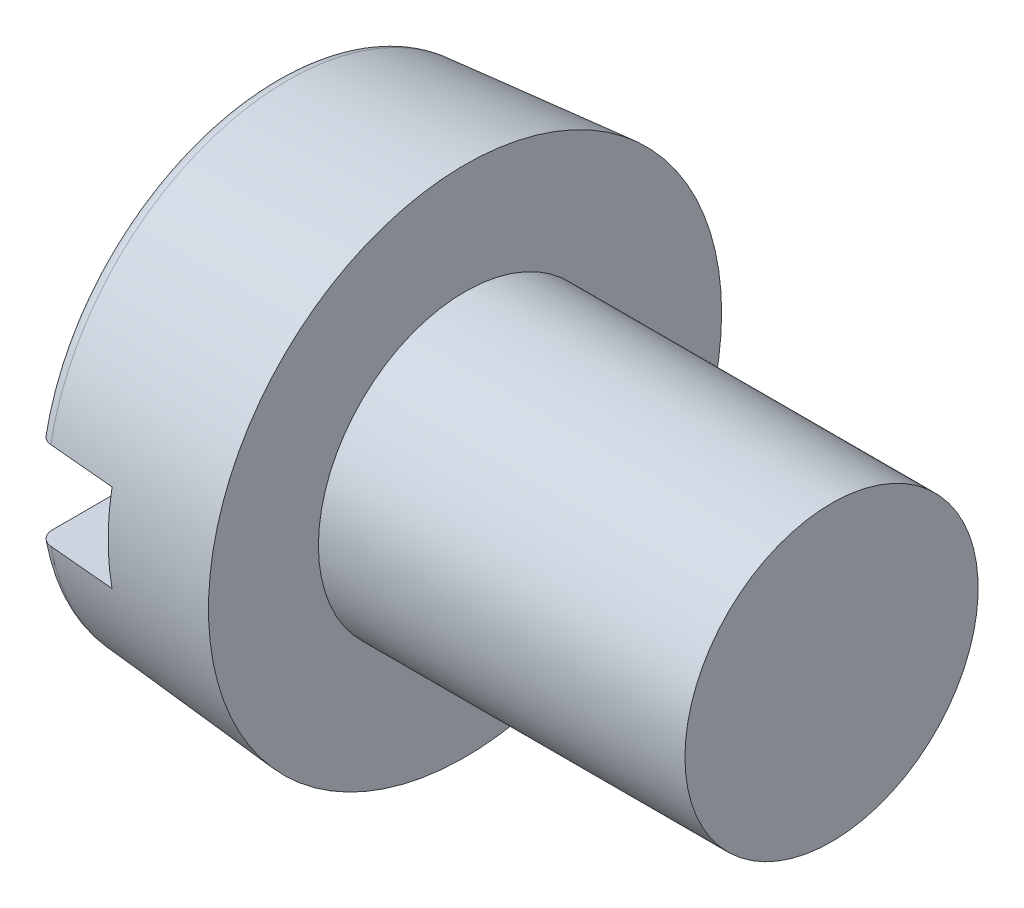
ISO-10303-21;
HEADER;
FILE_DESCRIPTION(('STEP AP214'),'2;1');
FILE_NAME('part.step','',(''),(''),'','','');
FILE_SCHEMA(('AUTOMOTIVE_DESIGN { 1 0 10303 214 1 1 1 1 }'));
ENDSEC;
DATA;
#1=APPLICATION_CONTEXT('core data for automotive mechanical design processes');
#2=APPLICATION_PROTOCOL_DEFINITION('international standard','automotive_design',2000,#1);
#3=PRODUCT_CONTEXT('',#1,'mechanical');
#4=PRODUCT('Part','Part','',(#3));
#5=PRODUCT_RELATED_PRODUCT_CATEGORY('part','',(#4));
#6=PRODUCT_DEFINITION_FORMATION('','',#4);
#7=PRODUCT_DEFINITION_CONTEXT('part definition',#1,'design');
#8=PRODUCT_DEFINITION('design','',#6,#7);
#9=PRODUCT_DEFINITION_SHAPE('','',#8);
#10=(LENGTH_UNIT() NAMED_UNIT(*) SI_UNIT(.MILLI.,.METRE.));
#11=(NAMED_UNIT(*) PLANE_ANGLE_UNIT() SI_UNIT($,.RADIAN.));
#12=(NAMED_UNIT(*) SI_UNIT($,.STERADIAN.) SOLID_ANGLE_UNIT());
#13=UNCERTAINTY_MEASURE_WITH_UNIT(LENGTH_MEASURE(1.E-05),#10,'distance_accuracy_value','');
#14=(GEOMETRIC_REPRESENTATION_CONTEXT(3) GLOBAL_UNCERTAINTY_ASSIGNED_CONTEXT((#13)) GLOBAL_UNIT_ASSIGNED_CONTEXT((#10,
#11,#12)) REPRESENTATION_CONTEXT('',''));
#15=CARTESIAN_POINT('',(0.,0.,0.));
#16=DIRECTION('',(0.,0.,1.));
#17=DIRECTION('',(1.,0.,0.));
#18=AXIS2_PLACEMENT_3D('',#15,#16,#17);
#19=CARTESIAN_POINT('',(1.1,0.6,-3.5));
#20=DIRECTION('',(-1.,0.,0.));
#21=DIRECTION('',(0.,0.,1.));
#22=AXIS2_PLACEMENT_3D('',#19,#20,#21);
#23=PLANE('',#22);
#24=DIRECTION('',(0.,0.,1.));
#25=VECTOR('',#24,1.);
#26=CARTESIAN_POINT('',(1.1,0.6,3.5));
#27=LINE('',#26,#25);
#28=CARTESIAN_POINT('',(1.10000000000466,0.6,3.31490439259874));
#29=VERTEX_POINT('',#28);
#30=CARTESIAN_POINT('',(1.10000000000405,0.6,-3.31490439259868));
#31=VERTEX_POINT('',#30);
#32=EDGE_CURVE('E78',#29,#31,#27,.F.);
#33=ORIENTED_EDGE('',*,*,#32,.T.);
#34=CARTESIAN_POINT('',(1.10000000000809,0.,0.));
#35=DIRECTION('',(1.,0.,0.));
#36=DIRECTION('',(0.,0.,-1.));
#37=AXIS2_PLACEMENT_3D('',#34,#35,#36);
#38=CIRCLE('',#37,3.36876700471737);
#39=CARTESIAN_POINT('',(1.10000000000468,-0.6,-3.31490439259874));
#40=VERTEX_POINT('',#39);
#41=EDGE_CURVE('E87',#31,#40,#38,.F.);
#42=ORIENTED_EDGE('',*,*,#41,.T.);
#43=DIRECTION('',(0.,0.,-1.));
#44=VECTOR('',#43,1.);
#45=CARTESIAN_POINT('',(1.1,-0.6,-3.5));
#46=LINE('',#45,#44);
#47=CARTESIAN_POINT('',(1.10000000000405,-0.600000000000001,3.31490439259868));
#48=VERTEX_POINT('',#47);
#49=EDGE_CURVE('E85',#40,#48,#46,.F.);
#50=ORIENTED_EDGE('',*,*,#49,.T.);
#51=CARTESIAN_POINT('',(1.10000000000809,0.,0.));
#52=DIRECTION('',(1.,0.,0.));
#53=DIRECTION('',(0.,0.,-1.));
#54=AXIS2_PLACEMENT_3D('',#51,#52,#53);
#55=CIRCLE('',#54,3.36876700471737);
#56=EDGE_CURVE('E20',#48,#29,#55,.F.);
#57=ORIENTED_EDGE('',*,*,#56,.T.);
#58=EDGE_LOOP('',(#33,#42,#50,#57));
#59=FACE_BOUND('',#58,.T.);
#60=ADVANCED_FACE('F17',(#59),#23,.T.);
#61=CARTESIAN_POINT('',(1.1,0.6,3.5));
#62=DIRECTION('',(0.,1.,0.));
#63=DIRECTION('',(0.,0.,1.));
#64=AXIS2_PLACEMENT_3D('',#61,#62,#63);
#65=PLANE('',#64);
#66=ORIENTED_EDGE('',*,*,#32,.F.);
#67=CARTESIAN_POINT('',(0.182568851454256,0.6,3.23330273645809));
#68=CARTESIAN_POINT('',(0.335473556850061,0.6,3.24690847681179));
#69=CARTESIAN_POINT('',(0.488378505260504,0.6,3.26051148500036));
#70=CARTESIAN_POINT('',(0.794188888109491,0.6,3.28771203704714));
#71=CARTESIAN_POINT('',(0.947094322548035,0.6,3.30130958090535));
#72=CARTESIAN_POINT('',(1.10000000000122,0.6,3.31490439259843));
#73=B_SPLINE_CURVE_WITH_KNOTS('',3,(#67,#68,#69,#70,#71,#72),.UNSPECIFIED.,.F.,.F.,(4,2,4),(0.,
0.460526530963861,0.921053061924176),.UNSPECIFIED.);
#74=CARTESIAN_POINT('',(0.182568851463089,0.6,3.23330273645694));
#75=VERTEX_POINT('',#74);
#76=EDGE_CURVE('E69',#75,#29,#73,.T.);
#77=ORIENTED_EDGE('',*,*,#76,.F.);
#78=CARTESIAN_POINT('',(0.,0.599999999999999,3.03043682761994));
#79=CARTESIAN_POINT('',(-8.92276711938872E-06,0.600000000000926,3.04205210805298));
#80=CARTESIAN_POINT('',(0.000973204864241999,0.600000000000543,3.05366618875901));
#81=CARTESIAN_POINT('',(0.0048583823746391,0.599999999999457,3.07656708233098));
#82=CARTESIAN_POINT('',(0.00776118005155454,0.599999999998755,3.08785393796157));
#83=CARTESIAN_POINT('',(0.0154293297762819,0.599999999999335,3.10978668687681));
#84=CARTESIAN_POINT('',(0.0201960317635953,0.600000000000619,3.12043210913728));
#85=CARTESIAN_POINT('',(0.0314639130665996,0.59999999999938,3.14075672068877));
#86=CARTESIAN_POINT('',(0.0379643576695787,0.599999999996858,3.15043631688841));
#87=CARTESIAN_POINT('',(0.0524560587306095,0.599999999997462,3.16845455019423));
#88=CARTESIAN_POINT('',(0.0604324501561322,0.600000000000534,3.17680513564901));
#89=CARTESIAN_POINT('',(0.0776955342490941,0.599999999999465,3.19201902933438));
#90=CARTESIAN_POINT('',(0.0869820289644172,0.599999999995325,3.19888256185703));
#91=CARTESIAN_POINT('',(0.106435856679454,0.599999999995523,3.21080710889614));
#92=CARTESIAN_POINT('',(0.116586055155842,0.599999999999723,3.2158960924536));
#93=CARTESIAN_POINT('',(0.137592975718863,0.600000000000275,3.22425888492082));
#94=CARTESIAN_POINT('',(0.148448535761883,0.59999999999664,3.22753559876399));
#95=CARTESIAN_POINT('',(0.167114441065982,0.599999999995137,3.23146563373131));
#96=CARTESIAN_POINT('',(0.174822526263816,0.599999999995827,3.23261780195108));
#97=CARTESIAN_POINT('',(0.18256885145479,0.6,3.23330273645209));
#98=B_SPLINE_CURVE_WITH_KNOTS('',3,(#78,#79,#80,#81,#82,#83,#84,#85,#86,#87,#88,#89,#90,#91,#92,
#93,#94,#95,#96,#97),.UNSPECIFIED.,.F.,.F.,(4,2,2,2,2,2,2,2,2,4),(0.,0.0348029281865724,
0.0696012873265984,0.104424896125296,0.139233771014052,0.173709468497491,0.208179962389296,
0.242079590894619,0.275924722159496,0.299249852575361),.UNSPECIFIED.);
#99=CARTESIAN_POINT('',(0.,0.6,3.03043682761994));
#100=VERTEX_POINT('',#99);
#101=EDGE_CURVE('E79',#100,#75,#98,.T.);
#102=ORIENTED_EDGE('',*,*,#101,.F.);
#103=DIRECTION('',(0.,0.,1.));
#104=VECTOR('',#103,1.);
#105=CARTESIAN_POINT('',(0.,0.6,0.));
#106=LINE('',#105,#104);
#107=CARTESIAN_POINT('',(0.,0.6,-3.03043682761994));
#108=VERTEX_POINT('',#107);
#109=EDGE_CURVE('E111',#108,#100,#106,.T.);
#110=ORIENTED_EDGE('',*,*,#109,.F.);
#111=CARTESIAN_POINT('',(0.182568851454788,0.599999999999999,-3.23330273645209));
#112=CARTESIAN_POINT('',(0.171472681594623,0.600000000000002,-3.23232565957753));
#113=CARTESIAN_POINT('',(0.160466490440903,0.600000000000001,-3.23038681875744));
#114=CARTESIAN_POINT('',(0.138948426592135,0.599999999999998,-3.22469378570043));
#115=CARTESIAN_POINT('',(0.128435940886201,0.599999999999996,-3.22094191371361));
#116=CARTESIAN_POINT('',(0.108187049490752,0.600000000000001,-3.21172671697903));
#117=CARTESIAN_POINT('',(0.0984508547008833,0.600000000000007,-3.20626292911875));
#118=CARTESIAN_POINT('',(0.0800245200002214,0.599999999999992,-3.193793084455));
#119=CARTESIAN_POINT('',(0.0713343007624212,0.59999999999997,-3.1867871447228));
#120=CARTESIAN_POINT('',(0.0551599248927894,0.600000000000032,-3.17137098416005));
#121=CARTESIAN_POINT('',(0.0476868506805745,0.600000000000117,-3.1629491407325));
#122=CARTESIAN_POINT('',(0.0342322998309484,0.599999999999882,-3.14498762109246));
#123=CARTESIAN_POINT('',(0.0282510437499762,0.599999999999561,-3.13544777989675));
#124=CARTESIAN_POINT('',(0.017840034395559,0.5999999999996,-3.11534500552784));
#125=CARTESIAN_POINT('',(0.0134390539697865,0.599999999999971,-3.10476717226775));
#126=CARTESIAN_POINT('',(0.00645122030947759,0.600000000000028,-3.08304101716856));
#127=CARTESIAN_POINT('',(0.00386248123053322,0.599999999999714,-3.07189330136284));
#128=CARTESIAN_POINT('',(0.000734376375379197,0.599999999999458,-3.05062255742231));
#129=CARTESIAN_POINT('',(-6.07384206114669E-06,0.599999999999478,-3.04052874119681));
#130=CARTESIAN_POINT('',(0.,0.599999999999999,-3.03043682761994));
#131=B_SPLINE_CURVE_WITH_KNOTS('',3,(#111,#112,#113,#114,#115,#116,#117,#118,#119,#120,#121,
#122,#123,#124,#125,#126,#127,#128,#129,#130),.UNSPECIFIED.,.F.,.F.,(4,2,2,2,2,2,2,2,2,4),(0.,
0.033369886991951,0.0666971810854079,0.100033498772122,0.133367286630274,0.166989405711503,
0.200616492680493,0.234828037616768,0.269003928393338,0.299257989197877),.UNSPECIFIED.);
#132=CARTESIAN_POINT('',(0.182568851462821,0.6,-3.23330273645994));
#133=VERTEX_POINT('',#132);
#134=EDGE_CURVE('E164',#133,#108,#131,.T.);
#135=ORIENTED_EDGE('',*,*,#134,.F.);
#136=CARTESIAN_POINT('',(1.10000000000126,0.6,-3.31490439259844));
#137=CARTESIAN_POINT('',(0.947094322548068,0.6,-3.30130958090535));
#138=CARTESIAN_POINT('',(0.794188888109517,0.6,-3.28771203704714));
#139=CARTESIAN_POINT('',(0.488378505260516,0.6,-3.26051148500036));
#140=CARTESIAN_POINT('',(0.335473556850066,0.6,-3.24690847681179));
#141=CARTESIAN_POINT('',(0.182568851454254,0.6,-3.23330273645809));
#142=B_SPLINE_CURVE_WITH_KNOTS('',3,(#136,#137,#138,#139,#140,#141),.UNSPECIFIED.,.F.,.F.,(4,2,
4),(0.,0.460526530960336,0.921053061924218),.UNSPECIFIED.);
#143=EDGE_CURVE('E90',#31,#133,#142,.T.);
#144=ORIENTED_EDGE('',*,*,#143,.F.);
#145=EDGE_LOOP('',(#66,#77,#102,#110,#135,#144));
#146=FACE_BOUND('',#145,.T.);
#147=ADVANCED_FACE('F88',(#146),#65,.F.);
#148=CARTESIAN_POINT('',(1.1,-0.6,-3.5));
#149=DIRECTION('',(0.,-1.,0.));
#150=DIRECTION('',(0.,0.,-1.));
#151=AXIS2_PLACEMENT_3D('',#148,#149,#150);
#152=PLANE('',#151);
#153=CARTESIAN_POINT('',(0.,-0.6,-3.03043682761993));
#154=CARTESIAN_POINT('',(-8.92276711936747E-06,-0.600000000000927,-3.04205210805298));
#155=CARTESIAN_POINT('',(0.000973204864241989,-0.600000000000543,-3.05366618875901));
#156=CARTESIAN_POINT('',(0.00485838237463901,-0.599999999999457,-3.07656708233098));
#157=CARTESIAN_POINT('',(0.00776118005155441,-0.599999999998754,-3.08785393796157));
#158=CARTESIAN_POINT('',(0.0154293297762817,-0.599999999999335,-3.10978668687681));
#159=CARTESIAN_POINT('',(0.020196031763595,-0.60000000000062,-3.12043210913728));
#160=CARTESIAN_POINT('',(0.0314639130665996,-0.59999999999938,-3.14075672068877));
#161=CARTESIAN_POINT('',(0.037964357669579,-0.599999999996857,-3.15043631688841));
#162=CARTESIAN_POINT('',(0.05245605873061,-0.599999999997461,-3.16845455019423));
#163=CARTESIAN_POINT('',(0.0604324501561325,-0.600000000000534,-3.17680513564901));
#164=CARTESIAN_POINT('',(0.0776955342490943,-0.599999999999465,-3.19201902933438));
#165=CARTESIAN_POINT('',(0.0869820289644173,-0.599999999995324,-3.19888256185703));
#166=CARTESIAN_POINT('',(0.106435856679454,-0.599999999995523,-3.21080710889614));
#167=CARTESIAN_POINT('',(0.116586055155843,-0.599999999999723,-3.2158960924536));
#168=CARTESIAN_POINT('',(0.137592975718864,-0.600000000000275,-3.22425888492082));
#169=CARTESIAN_POINT('',(0.148448535761883,-0.599999999996639,-3.22753559876399));
#170=CARTESIAN_POINT('',(0.167114441066279,-0.599999999995136,-3.23146563373137));
#171=CARTESIAN_POINT('',(0.174822526264416,-0.599999999995827,-3.23261780195117));
#172=CARTESIAN_POINT('',(0.182568851455695,-0.600000000000001,-3.23330273645217));
#173=B_SPLINE_CURVE_WITH_KNOTS('',3,(#153,#154,#155,#156,#157,#158,#159,#160,#161,#162,#163,
#164,#165,#166,#167,#168,#169,#170,#171,#172),.UNSPECIFIED.,.F.,.F.,(4,2,2,2,2,2,2,2,2,4),(0.,
0.0348029281865724,0.0696012873265988,0.104424896125296,0.139233771014053,0.173709468497492,
0.208179962389297,0.24207959089462,0.275924722159498,0.299249852576269),.UNSPECIFIED.);
#174=CARTESIAN_POINT('',(0.,-0.599999999999999,-3.03043682761993));
#175=VERTEX_POINT('',#174);
#176=CARTESIAN_POINT('',(0.182568851463541,-0.6,-3.23330273645698));
#177=VERTEX_POINT('',#176);
#178=EDGE_CURVE('E112',#175,#177,#173,.T.);
#179=ORIENTED_EDGE('',*,*,#178,.F.);
#180=DIRECTION('',(0.,0.,1.));
#181=VECTOR('',#180,1.);
#182=CARTESIAN_POINT('',(0.,-0.6,0.));
#183=LINE('',#182,#181);
#184=CARTESIAN_POINT('',(0.,-0.600000000000001,3.03043682761993));
#185=VERTEX_POINT('',#184);
#186=EDGE_CURVE('E187',#185,#175,#183,.F.);
#187=ORIENTED_EDGE('',*,*,#186,.F.);
#188=CARTESIAN_POINT('',(0.18256885145479,-0.600000000000002,3.23330273645209));
#189=CARTESIAN_POINT('',(0.171472681594625,-0.600000000000002,3.23232565957753));
#190=CARTESIAN_POINT('',(0.160466490440905,-0.600000000000001,3.23038681875744));
#191=CARTESIAN_POINT('',(0.138948426592136,-0.6,3.22469378570043));
#192=CARTESIAN_POINT('',(0.128435940886202,-0.6,3.22094191371361));
#193=CARTESIAN_POINT('',(0.108187049490754,-0.600000000000004,3.21172671697903));
#194=CARTESIAN_POINT('',(0.0984508547008849,-0.600000000000009,3.20626292911875));
#195=CARTESIAN_POINT('',(0.0800245200002227,-0.599999999999992,3.19379308445501));
#196=CARTESIAN_POINT('',(0.0713343007624224,-0.59999999999997,3.1867871447228));
#197=CARTESIAN_POINT('',(0.0551599248927908,-0.600000000000033,3.17137098416005));
#198=CARTESIAN_POINT('',(0.0476868506805764,-0.600000000000118,3.1629491407325));
#199=CARTESIAN_POINT('',(0.0342322998309501,-0.599999999999883,3.14498762109247));
#200=CARTESIAN_POINT('',(0.0282510437499773,-0.599999999999562,3.13544777989675));
#201=CARTESIAN_POINT('',(0.0178400343955597,-0.5999999999996,3.11534500552784));
#202=CARTESIAN_POINT('',(0.0134390539697875,-0.599999999999972,3.10476717226775));
#203=CARTESIAN_POINT('',(0.00645122030947848,-0.600000000000029,3.08304101716856));
#204=CARTESIAN_POINT('',(0.00386248123053382,-0.599999999999714,3.07189330136284));
#205=CARTESIAN_POINT('',(0.00073437637537923,-0.599999999999459,3.05062255742231));
#206=CARTESIAN_POINT('',(-6.07384206128968E-06,-0.599999999999479,3.04052874119681));
#207=CARTESIAN_POINT('',(0.,-0.600000000000001,3.03043682761993));
#208=B_SPLINE_CURVE_WITH_KNOTS('',3,(#188,#189,#190,#191,#192,#193,#194,#195,#196,#197,#198,
#199,#200,#201,#202,#203,#204,#205,#206,#207),.UNSPECIFIED.,.F.,.F.,(4,2,2,2,2,2,2,2,2,4),(0.,
0.0333698869919509,0.0666971810854078,0.100033498772122,0.133367286630274,0.166989405711502,
0.200616492680492,0.234828037616767,0.269003928393338,0.29925798919788),.UNSPECIFIED.);
#209=CARTESIAN_POINT('',(0.182568851462822,-0.600000000000001,3.23330273645994));
#210=VERTEX_POINT('',#209);
#211=EDGE_CURVE('E35',#210,#185,#208,.T.);
#212=ORIENTED_EDGE('',*,*,#211,.F.);
#213=CARTESIAN_POINT('',(1.10000000000122,-0.600000000000001,3.31490439259843));
#214=CARTESIAN_POINT('',(0.947094322548035,-0.600000000000001,3.30130958090535));
#215=CARTESIAN_POINT('',(0.794188888109491,-0.600000000000001,3.28771203704714));
#216=CARTESIAN_POINT('',(0.488378505260504,-0.600000000000001,3.26051148500036));
#217=CARTESIAN_POINT('',(0.33547355685006,-0.600000000000001,3.24690847681179));
#218=CARTESIAN_POINT('',(0.182568851454256,-0.600000000000001,3.23330273645809));
#219=B_SPLINE_CURVE_WITH_KNOTS('',3,(#213,#214,#215,#216,#217,#218),.UNSPECIFIED.,.F.,.F.,(4,2,
4),(0.,0.460526530960315,0.921053061924176),.UNSPECIFIED.);
#220=EDGE_CURVE('E130',#48,#210,#219,.T.);
#221=ORIENTED_EDGE('',*,*,#220,.F.);
#222=ORIENTED_EDGE('',*,*,#49,.F.);
#223=CARTESIAN_POINT('',(0.182568851455161,-0.6,-3.23330273645818));
#224=CARTESIAN_POINT('',(0.335473556850822,-0.6,-3.24690847681186));
#225=CARTESIAN_POINT('',(0.488378505261121,-0.6,-3.26051148500042));
#226=CARTESIAN_POINT('',(0.79418888810982,-0.6,-3.28771203704717));
#227=CARTESIAN_POINT('',(0.94709432254822,-0.6,-3.30130958090537));
#228=CARTESIAN_POINT('',(1.10000000000126,-0.6,-3.31490439259844));
#229=B_SPLINE_CURVE_WITH_KNOTS('',3,(#223,#224,#225,#226,#227,#228),.UNSPECIFIED.,.F.,.F.,(4,2,
4),(0.,0.460526530963427,0.921053061923307),.UNSPECIFIED.);
#230=EDGE_CURVE('E102',#177,#40,#229,.T.);
#231=ORIENTED_EDGE('',*,*,#230,.F.);
#232=EDGE_LOOP('',(#179,#187,#212,#221,#222,#231));
#233=FACE_BOUND('',#232,.T.);
#234=ADVANCED_FACE('F114',(#233),#152,.F.);
#235=CARTESIAN_POINT('',(0.,0.,0.));
#236=DIRECTION('',(-1.,0.,0.));
#237=DIRECTION('',(0.,0.,1.));
#238=AXIS2_PLACEMENT_3D('',#235,#236,#237);
#239=PLANE('',#238);
#240=ORIENTED_EDGE('',*,*,#109,.T.);
#241=CARTESIAN_POINT('',(0.,0.,0.));
#242=DIRECTION('',(1.,0.,0.));
#243=DIRECTION('',(0.,0.194221066118776,-0.980957785776578));
#244=AXIS2_PLACEMENT_3D('',#241,#242,#243);
#245=CIRCLE('',#244,3.08926324002911);
#246=EDGE_CURVE('E194',#108,#100,#245,.T.);
#247=ORIENTED_EDGE('',*,*,#246,.F.);
#248=EDGE_LOOP('',(#240,#247));
#249=FACE_BOUND('',#248,.T.);
#250=ADVANCED_FACE('F215',(#249),#239,.T.);
#251=CARTESIAN_POINT('',(0.,0.,0.));
#252=DIRECTION('',(-1.,0.,0.));
#253=DIRECTION('',(0.,0.,1.));
#254=AXIS2_PLACEMENT_3D('',#251,#252,#253);
#255=PLANE('',#254);
#256=ORIENTED_EDGE('',*,*,#186,.T.);
#257=CARTESIAN_POINT('',(0.,0.,0.));
#258=DIRECTION('',(1.,0.,0.));
#259=DIRECTION('',(0.,-0.194221066118777,0.980957785776578));
#260=AXIS2_PLACEMENT_3D('',#257,#258,#259);
#261=CIRCLE('',#260,3.08926324002911);
#262=EDGE_CURVE('E179',#185,#175,#261,.T.);
#263=ORIENTED_EDGE('',*,*,#262,.F.);
#264=EDGE_LOOP('',(#256,#263));
#265=FACE_BOUND('',#264,.T.);
#266=ADVANCED_FACE('F170',(#265),#255,.T.);
#267=CARTESIAN_POINT('',(0.2,0.,0.));
#268=DIRECTION('',(-1.,0.,0.));
#269=DIRECTION('',(0.,0.,1.));
#270=AXIS2_PLACEMENT_3D('',#267,#268,#269);
#271=TOROIDAL_SURFACE('',#270,3.08926324002911,0.2);
#272=ORIENTED_EDGE('',*,*,#101,.T.);
#273=CARTESIAN_POINT('',(0.182568851471387,0.,0.));
#274=DIRECTION('',(1.,0.,0.));
#275=DIRECTION('',(0.,0.,-1.));
#276=AXIS2_PLACEMENT_3D('',#273,#274,#275);
#277=CIRCLE('',#276,3.28850217965737);
#278=EDGE_CURVE('E75',#133,#75,#277,.T.);
#279=ORIENTED_EDGE('',*,*,#278,.F.);
#280=ORIENTED_EDGE('',*,*,#134,.T.);
#281=ORIENTED_EDGE('',*,*,#246,.T.);
#282=EDGE_LOOP('',(#272,#279,#280,#281));
#283=FACE_BOUND('',#282,.T.);
#284=ADVANCED_FACE('F165',(#283),#271,.T.);
#285=CARTESIAN_POINT('',(0.2,0.,0.));
#286=DIRECTION('',(-1.,0.,0.));
#287=DIRECTION('',(0.,0.,1.));
#288=AXIS2_PLACEMENT_3D('',#285,#286,#287);
#289=TOROIDAL_SURFACE('',#288,3.08926324002911,0.2);
#290=ORIENTED_EDGE('',*,*,#211,.T.);
#291=ORIENTED_EDGE('',*,*,#262,.T.);
#292=ORIENTED_EDGE('',*,*,#178,.T.);
#293=CARTESIAN_POINT('',(0.182568851471387,0.,0.));
#294=DIRECTION('',(1.,0.,0.));
#295=DIRECTION('',(0.,0.,-1.));
#296=AXIS2_PLACEMENT_3D('',#293,#294,#295);
#297=CIRCLE('',#296,3.28850217965737);
#298=EDGE_CURVE('E101',#210,#177,#297,.T.);
#299=ORIENTED_EDGE('',*,*,#298,.F.);
#300=EDGE_LOOP('',(#290,#291,#292,#299));
#301=FACE_BOUND('',#300,.T.);
#302=ADVANCED_FACE('F122',(#301),#289,.T.);
#303=CARTESIAN_POINT('',(2.59999999997262,0.,0.));
#304=DIRECTION('',(1.,0.,0.));
#305=DIRECTION('',(0.,0.,-1.));
#306=AXIS2_PLACEMENT_3D('',#303,#304,#305);
#307=CONICAL_SURFACE('',#306,3.5000000000025,0.0872664625992853);
#308=ORIENTED_EDGE('',*,*,#56,.F.);
#309=ORIENTED_EDGE('',*,*,#220,.T.);
#310=ORIENTED_EDGE('',*,*,#298,.T.);
#311=ORIENTED_EDGE('',*,*,#230,.T.);
#312=ORIENTED_EDGE('',*,*,#41,.F.);
#313=ORIENTED_EDGE('',*,*,#143,.T.);
#314=ORIENTED_EDGE('',*,*,#278,.T.);
#315=ORIENTED_EDGE('',*,*,#76,.T.);
#316=EDGE_LOOP('',(#308,#309,#310,#311,#312,#313,#314,#315));
#317=FACE_BOUND('',#316,.T.);
#318=CARTESIAN_POINT('',(2.59999999997262,0.,0.));
#319=DIRECTION('',(1.,0.,0.));
#320=DIRECTION('',(0.,0.,-1.));
#321=AXIS2_PLACEMENT_3D('',#318,#319,#320);
#322=CIRCLE('',#321,3.5000000000025);
#323=CARTESIAN_POINT('',(2.59999999997262,0.,-3.5000000000025));
#324=VERTEX_POINT('',#323);
#325=EDGE_CURVE('E98',#324,#324,#322,.F.);
#326=ORIENTED_EDGE('',*,*,#325,.T.);
#327=EDGE_LOOP('',(#326));
#328=FACE_BOUND('',#327,.T.);
#329=ADVANCED_FACE('F71',(#317,#328),#307,.T.);
#330=CARTESIAN_POINT('',(7.6,2.,0.));
#331=DIRECTION('',(1.,0.,0.));
#332=DIRECTION('',(0.,0.,-1.));
#333=AXIS2_PLACEMENT_3D('',#330,#331,#332);
#334=PLANE('',#333);
#335=CARTESIAN_POINT('',(7.6,0.,0.));
#336=DIRECTION('',(-1.,0.,0.));
#337=DIRECTION('',(0.,0.,1.));
#338=AXIS2_PLACEMENT_3D('',#335,#336,#337);
#339=CIRCLE('',#338,2.);
#340=CARTESIAN_POINT('',(7.6,0.,2.));
#341=VERTEX_POINT('',#340);
#342=EDGE_CURVE('E26',#341,#341,#339,.T.);
#343=ORIENTED_EDGE('',*,*,#342,.F.);
#344=EDGE_LOOP('',(#343));
#345=FACE_BOUND('',#344,.T.);
#346=ADVANCED_FACE('F121',(#345),#334,.T.);
#347=CARTESIAN_POINT('',(2.6,2.,0.));
#348=DIRECTION('',(-1.,0.,0.));
#349=DIRECTION('',(0.,0.,1.));
#350=AXIS2_PLACEMENT_3D('',#347,#348,#349);
#351=PLANE('',#350);
#352=CARTESIAN_POINT('',(2.6,0.,0.));
#353=DIRECTION('',(-1.,0.,0.));
#354=DIRECTION('',(0.,0.,1.));
#355=AXIS2_PLACEMENT_3D('',#352,#353,#354);
#356=CIRCLE('',#355,2.);
#357=CARTESIAN_POINT('',(2.6,0.,2.));
#358=VERTEX_POINT('',#357);
#359=EDGE_CURVE('E11',#358,#358,#356,.F.);
#360=ORIENTED_EDGE('',*,*,#359,.F.);
#361=EDGE_LOOP('',(#360));
#362=FACE_BOUND('',#361,.T.);
#363=ORIENTED_EDGE('',*,*,#325,.F.);
#364=EDGE_LOOP('',(#363));
#365=FACE_BOUND('',#364,.T.);
#366=ADVANCED_FACE('F231',(#362,#365),#351,.F.);
#367=CARTESIAN_POINT('',(-25.4,0.,0.));
#368=DIRECTION('',(-1.,0.,0.));
#369=DIRECTION('',(0.,0.,1.));
#370=AXIS2_PLACEMENT_3D('',#367,#368,#369);
#371=CYLINDRICAL_SURFACE('',#370,2.);
#372=ORIENTED_EDGE('',*,*,#359,.T.);
#373=EDGE_LOOP('',(#372));
#374=FACE_BOUND('',#373,.T.);
#375=ORIENTED_EDGE('',*,*,#342,.T.);
#376=EDGE_LOOP('',(#375));
#377=FACE_BOUND('',#376,.T.);
#378=ADVANCED_FACE('F229',(#374,#377),#371,.T.);
#379=CLOSED_SHELL('',(#60,#147,#234,#250,#266,#284,#302,#329,#346,#366,#378));
#380=MANIFOLD_SOLID_BREP('B1',#379);
#381=ADVANCED_BREP_SHAPE_REPRESENTATION('',(#18,#380),#14);
#382=SHAPE_DEFINITION_REPRESENTATION(#9,#381);
ENDSEC;
END-ISO-10303-21;
